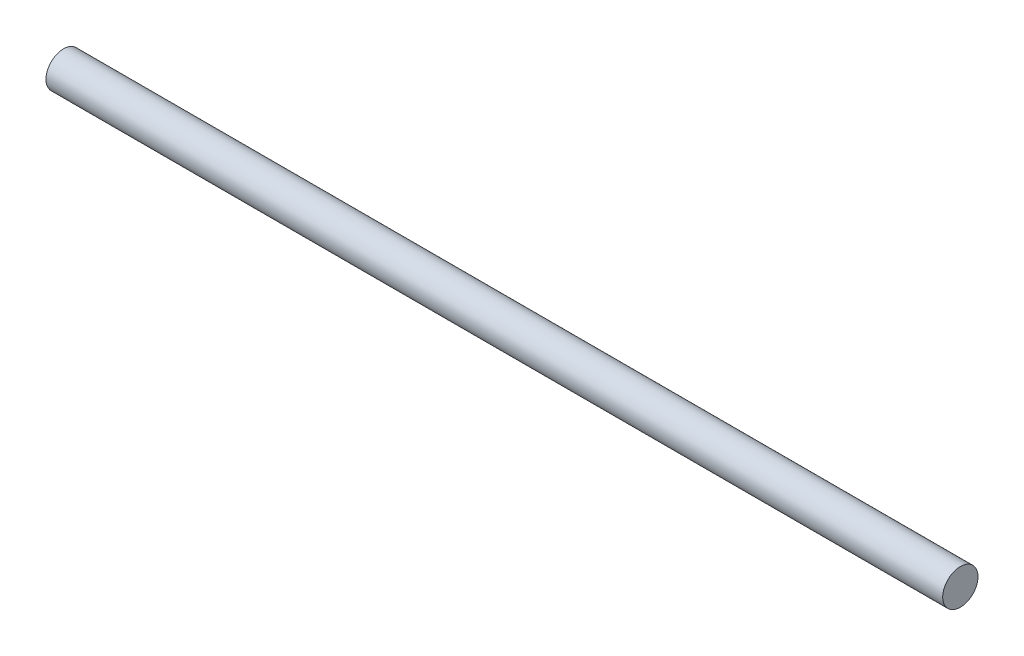
ISO-10303-21;
HEADER;
FILE_DESCRIPTION(('STEP AP214'),'2;1');
FILE_NAME('part.step','',(''),(''),'','','');
FILE_SCHEMA(('AUTOMOTIVE_DESIGN { 1 0 10303 214 1 1 1 1 }'));
ENDSEC;
DATA;
#1=APPLICATION_CONTEXT('core data for automotive mechanical design processes');
#2=APPLICATION_PROTOCOL_DEFINITION('international standard','automotive_design',2000,#1);
#3=PRODUCT_CONTEXT('',#1,'mechanical');
#4=PRODUCT('Part','Part','',(#3));
#5=PRODUCT_RELATED_PRODUCT_CATEGORY('part','',(#4));
#6=PRODUCT_DEFINITION_FORMATION('','',#4);
#7=PRODUCT_DEFINITION_CONTEXT('part definition',#1,'design');
#8=PRODUCT_DEFINITION('design','',#6,#7);
#9=PRODUCT_DEFINITION_SHAPE('','',#8);
#10=(LENGTH_UNIT() NAMED_UNIT(*) SI_UNIT(.MILLI.,.METRE.));
#11=(NAMED_UNIT(*) PLANE_ANGLE_UNIT() SI_UNIT($,.RADIAN.));
#12=(NAMED_UNIT(*) SI_UNIT($,.STERADIAN.) SOLID_ANGLE_UNIT());
#13=UNCERTAINTY_MEASURE_WITH_UNIT(LENGTH_MEASURE(1.E-05),#10,'distance_accuracy_value','');
#14=(GEOMETRIC_REPRESENTATION_CONTEXT(3) GLOBAL_UNCERTAINTY_ASSIGNED_CONTEXT((#13)) GLOBAL_UNIT_ASSIGNED_CONTEXT((#10,
#11,#12)) REPRESENTATION_CONTEXT('',''));
#15=CARTESIAN_POINT('',(0.,0.,0.));
#16=DIRECTION('',(0.,0.,1.));
#17=DIRECTION('',(1.,0.,0.));
#18=AXIS2_PLACEMENT_3D('',#15,#16,#17);
#19=CARTESIAN_POINT('',(101.6,0.,0.));
#20=DIRECTION('',(-1.,0.,0.));
#21=DIRECTION('',(0.,0.,1.));
#22=AXIS2_PLACEMENT_3D('',#19,#20,#21);
#23=CYLINDRICAL_SURFACE('',#22,2.);
#24=CARTESIAN_POINT('',(101.6,0.,0.));
#25=DIRECTION('',(1.,0.,0.));
#26=DIRECTION('',(0.,0.,-1.));
#27=AXIS2_PLACEMENT_3D('',#24,#25,#26);
#28=CIRCLE('',#27,2.);
#29=CARTESIAN_POINT('',(101.6,0.,-2.));
#30=VERTEX_POINT('',#29);
#31=EDGE_CURVE('E10',#30,#30,#28,.T.);
#32=ORIENTED_EDGE('',*,*,#31,.F.);
#33=EDGE_LOOP('',(#32));
#34=FACE_BOUND('',#33,.T.);
#35=CARTESIAN_POINT('',(0.,0.,0.));
#36=DIRECTION('',(1.,0.,0.));
#37=DIRECTION('',(0.,0.,-1.));
#38=AXIS2_PLACEMENT_3D('',#35,#36,#37);
#39=CIRCLE('',#38,2.);
#40=CARTESIAN_POINT('',(0.,0.,-2.));
#41=VERTEX_POINT('',#40);
#42=EDGE_CURVE('E33',#41,#41,#39,.T.);
#43=ORIENTED_EDGE('',*,*,#42,.T.);
#44=EDGE_LOOP('',(#43));
#45=FACE_BOUND('',#44,.T.);
#46=ADVANCED_FACE('F30',(#34,#45),#23,.T.);
#47=CARTESIAN_POINT('',(101.6,0.,0.));
#48=DIRECTION('',(1.,0.,0.));
#49=DIRECTION('',(0.,0.,-1.));
#50=AXIS2_PLACEMENT_3D('',#47,#48,#49);
#51=PLANE('',#50);
#52=ORIENTED_EDGE('',*,*,#31,.T.);
#53=EDGE_LOOP('',(#52));
#54=FACE_BOUND('',#53,.T.);
#55=ADVANCED_FACE('F45',(#54),#51,.T.);
#56=CARTESIAN_POINT('',(0.,0.,0.));
#57=DIRECTION('',(1.,0.,0.));
#58=DIRECTION('',(0.,0.,-1.));
#59=AXIS2_PLACEMENT_3D('',#56,#57,#58);
#60=PLANE('',#59);
#61=ORIENTED_EDGE('',*,*,#42,.F.);
#62=EDGE_LOOP('',(#61));
#63=FACE_BOUND('',#62,.T.);
#64=ADVANCED_FACE('F43',(#63),#60,.F.);
#65=CLOSED_SHELL('',(#46,#55,#64));
#66=MANIFOLD_SOLID_BREP('B2',#65);
#67=ADVANCED_BREP_SHAPE_REPRESENTATION('',(#18,#66),#14);
#68=SHAPE_DEFINITION_REPRESENTATION(#9,#67);
ENDSEC;
END-ISO-10303-21;
